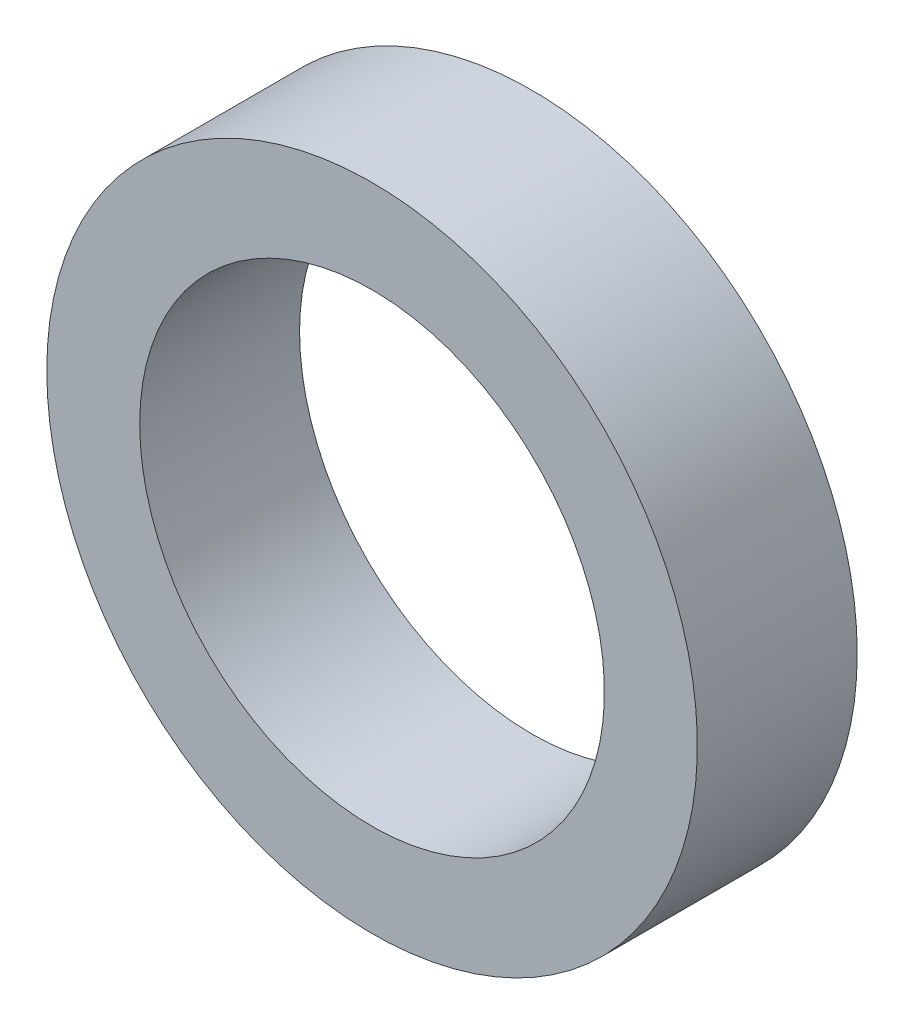
ISO-10303-21;
HEADER;
FILE_DESCRIPTION(('STEP AP214'),'2;1');
FILE_NAME('part.step','',(''),(''),'','','');
FILE_SCHEMA(('AUTOMOTIVE_DESIGN { 1 0 10303 214 1 1 1 1 }'));
ENDSEC;
DATA;
#1=APPLICATION_CONTEXT('core data for automotive mechanical design processes');
#2=APPLICATION_PROTOCOL_DEFINITION('international standard','automotive_design',2000,#1);
#3=PRODUCT_CONTEXT('',#1,'mechanical');
#4=PRODUCT('Part','Part','',(#3));
#5=PRODUCT_RELATED_PRODUCT_CATEGORY('part','',(#4));
#6=PRODUCT_DEFINITION_FORMATION('','',#4);
#7=PRODUCT_DEFINITION_CONTEXT('part definition',#1,'design');
#8=PRODUCT_DEFINITION('design','',#6,#7);
#9=PRODUCT_DEFINITION_SHAPE('','',#8);
#10=(LENGTH_UNIT() NAMED_UNIT(*) SI_UNIT(.MILLI.,.METRE.));
#11=(NAMED_UNIT(*) PLANE_ANGLE_UNIT() SI_UNIT($,.RADIAN.));
#12=(NAMED_UNIT(*) SI_UNIT($,.STERADIAN.) SOLID_ANGLE_UNIT());
#13=UNCERTAINTY_MEASURE_WITH_UNIT(LENGTH_MEASURE(1.E-05),#10,'distance_accuracy_value','');
#14=(GEOMETRIC_REPRESENTATION_CONTEXT(3) GLOBAL_UNCERTAINTY_ASSIGNED_CONTEXT((#13)) GLOBAL_UNIT_ASSIGNED_CONTEXT((#10,
#11,#12)) REPRESENTATION_CONTEXT('',''));
#15=CARTESIAN_POINT('',(0.,0.,0.));
#16=DIRECTION('',(0.,0.,1.));
#17=DIRECTION('',(1.,0.,0.));
#18=AXIS2_PLACEMENT_3D('',#15,#16,#17);
#19=CARTESIAN_POINT('',(0.,-64.9999999999998,0.));
#20=DIRECTION('',(0.,0.,1.));
#21=DIRECTION('',(1.,0.,0.));
#22=AXIS2_PLACEMENT_3D('',#19,#20,#21);
#23=PLANE('',#22);
#24=CARTESIAN_POINT('',(0.,-64.9999999999998,0.));
#25=DIRECTION('',(0.,0.,1.));
#26=DIRECTION('',(1.,0.,0.));
#27=AXIS2_PLACEMENT_3D('',#24,#25,#26);
#28=CIRCLE('',#27,17.5);
#29=CARTESIAN_POINT('',(17.5000000000001,-64.9999999999998,0.));
#30=VERTEX_POINT('',#29);
#31=EDGE_CURVE('E41',#30,#30,#28,.T.);
#32=ORIENTED_EDGE('',*,*,#31,.F.);
#33=EDGE_LOOP('',(#32));
#34=FACE_BOUND('',#33,.T.);
#35=CARTESIAN_POINT('',(0.,-64.9999999999998,0.));
#36=DIRECTION('',(0.,0.,1.));
#37=DIRECTION('',(1.,0.,0.));
#38=AXIS2_PLACEMENT_3D('',#35,#36,#37);
#39=CIRCLE('',#38,12.5);
#40=CARTESIAN_POINT('',(12.5000000000001,-64.9999999999998,0.));
#41=VERTEX_POINT('',#40);
#42=EDGE_CURVE('E50',#41,#41,#39,.T.);
#43=ORIENTED_EDGE('',*,*,#42,.T.);
#44=EDGE_LOOP('',(#43));
#45=FACE_BOUND('',#44,.T.);
#46=ADVANCED_FACE('F34',(#34,#45),#23,.F.);
#47=CARTESIAN_POINT('',(0.,-64.9999999999998,60.0974746830583));
#48=DIRECTION('',(0.,0.,-1.));
#49=DIRECTION('',(-1.,0.,0.));
#50=AXIS2_PLACEMENT_3D('',#47,#48,#49);
#51=CYLINDRICAL_SURFACE('',#50,17.5);
#52=CARTESIAN_POINT('',(0.,-64.9999999999998,8.59999999999993));
#53=DIRECTION('',(0.,0.,-1.));
#54=DIRECTION('',(-1.,0.,0.));
#55=AXIS2_PLACEMENT_3D('',#52,#53,#54);
#56=CIRCLE('',#55,17.5);
#57=CARTESIAN_POINT('',(-17.4999999999999,-64.9999999999998,8.59999999999993));
#58=VERTEX_POINT('',#57);
#59=EDGE_CURVE('E45',#58,#58,#56,.T.);
#60=ORIENTED_EDGE('',*,*,#59,.T.);
#61=EDGE_LOOP('',(#60));
#62=FACE_BOUND('',#61,.T.);
#63=ORIENTED_EDGE('',*,*,#31,.T.);
#64=EDGE_LOOP('',(#63));
#65=FACE_BOUND('',#64,.T.);
#66=ADVANCED_FACE('F58',(#62,#65),#51,.T.);
#67=CARTESIAN_POINT('',(0.,-64.9999999999998,60.0974746830583));
#68=DIRECTION('',(0.,0.,-1.));
#69=DIRECTION('',(-1.,0.,0.));
#70=AXIS2_PLACEMENT_3D('',#67,#68,#69);
#71=CYLINDRICAL_SURFACE('',#70,12.5);
#72=CARTESIAN_POINT('',(0.,-64.9999999999998,8.59999999999993));
#73=DIRECTION('',(0.,0.,-1.));
#74=DIRECTION('',(-1.,0.,0.));
#75=AXIS2_PLACEMENT_3D('',#72,#73,#74);
#76=CIRCLE('',#75,12.5);
#77=CARTESIAN_POINT('',(-12.4999999999999,-64.9999999999998,8.59999999999993));
#78=VERTEX_POINT('',#77);
#79=EDGE_CURVE('E11',#78,#78,#76,.T.);
#80=ORIENTED_EDGE('',*,*,#79,.F.);
#81=EDGE_LOOP('',(#80));
#82=FACE_BOUND('',#81,.T.);
#83=ORIENTED_EDGE('',*,*,#42,.F.);
#84=EDGE_LOOP('',(#83));
#85=FACE_BOUND('',#84,.T.);
#86=ADVANCED_FACE('F56',(#82,#85),#71,.F.);
#87=CARTESIAN_POINT('',(83.2523029747527,-65.4753781541539,8.59999999999993));
#88=DIRECTION('',(0.,0.,-1.));
#89=DIRECTION('',(-0.903164585908277,0.429294456942005,0.));
#90=AXIS2_PLACEMENT_3D('',#87,#88,#89);
#91=PLANE('',#90);
#92=ORIENTED_EDGE('',*,*,#79,.T.);
#93=EDGE_LOOP('',(#92));
#94=FACE_BOUND('',#93,.T.);
#95=ORIENTED_EDGE('',*,*,#59,.F.);
#96=EDGE_LOOP('',(#95));
#97=FACE_BOUND('',#96,.T.);
#98=ADVANCED_FACE('F36',(#94,#97),#91,.F.);
#99=CLOSED_SHELL('',(#46,#66,#86,#98));
#100=MANIFOLD_SOLID_BREP('B2',#99);
#101=ADVANCED_BREP_SHAPE_REPRESENTATION('',(#18,#100),#14);
#102=SHAPE_DEFINITION_REPRESENTATION(#9,#101);
ENDSEC;
END-ISO-10303-21;
